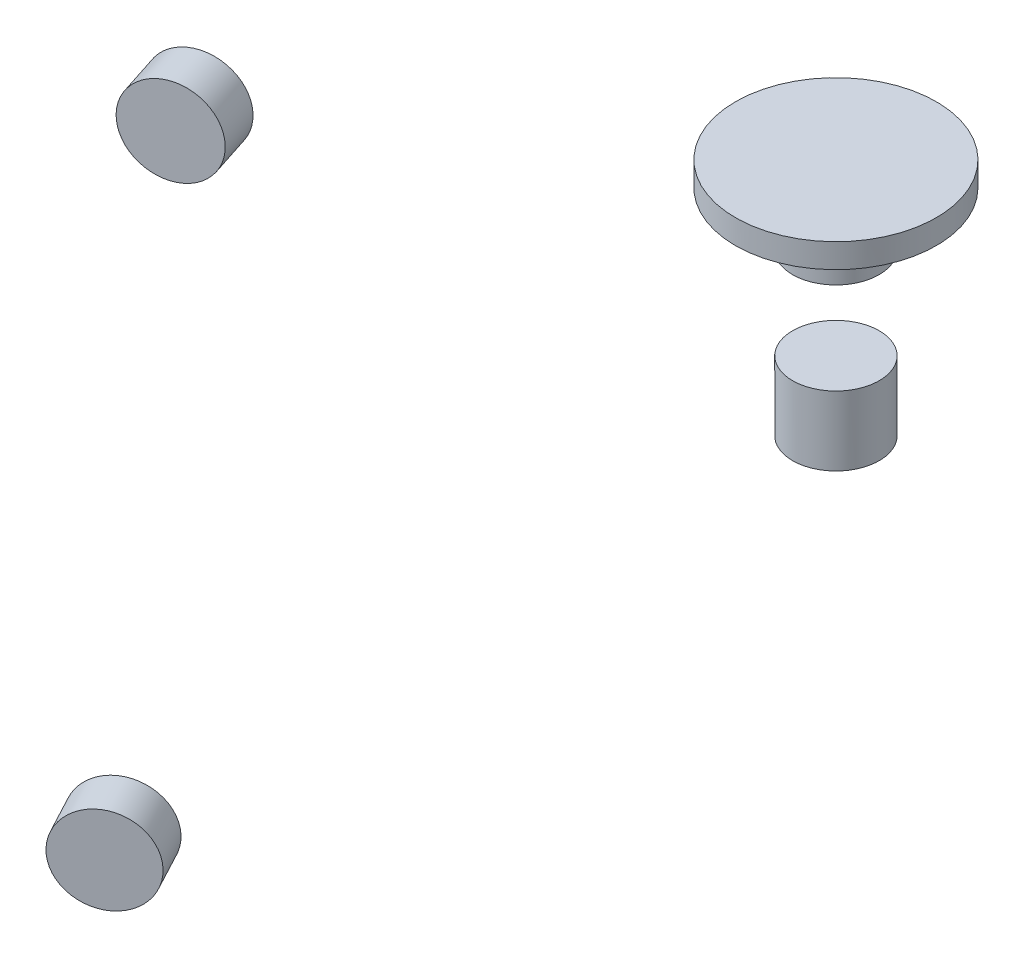
ISO-10303-21;
HEADER;
FILE_DESCRIPTION(('STEP AP214'),'2;1');
FILE_NAME('part.step','',(''),(''),'','','');
FILE_SCHEMA(('AUTOMOTIVE_DESIGN { 1 0 10303 214 1 1 1 1 }'));
ENDSEC;
DATA;
#1=APPLICATION_CONTEXT('core data for automotive mechanical design processes');
#2=APPLICATION_PROTOCOL_DEFINITION('international standard','automotive_design',2000,#1);
#3=PRODUCT_CONTEXT('',#1,'mechanical');
#4=PRODUCT('Part','Part','',(#3));
#5=PRODUCT_RELATED_PRODUCT_CATEGORY('part','',(#4));
#6=PRODUCT_DEFINITION_FORMATION('','',#4);
#7=PRODUCT_DEFINITION_CONTEXT('part definition',#1,'design');
#8=PRODUCT_DEFINITION('design','',#6,#7);
#9=PRODUCT_DEFINITION_SHAPE('','',#8);
#10=(LENGTH_UNIT() NAMED_UNIT(*) SI_UNIT(.MILLI.,.METRE.));
#11=(NAMED_UNIT(*) PLANE_ANGLE_UNIT() SI_UNIT($,.RADIAN.));
#12=(NAMED_UNIT(*) SI_UNIT($,.STERADIAN.) SOLID_ANGLE_UNIT());
#13=UNCERTAINTY_MEASURE_WITH_UNIT(LENGTH_MEASURE(1.E-05),#10,'distance_accuracy_value','');
#14=(GEOMETRIC_REPRESENTATION_CONTEXT(3) GLOBAL_UNCERTAINTY_ASSIGNED_CONTEXT((#13)) GLOBAL_UNIT_ASSIGNED_CONTEXT((#10,
#11,#12)) REPRESENTATION_CONTEXT('',''));
#15=CARTESIAN_POINT('',(0.,0.,0.));
#16=DIRECTION('',(0.,0.,1.));
#17=DIRECTION('',(1.,0.,0.));
#18=AXIS2_PLACEMENT_3D('',#15,#16,#17);
#19=CARTESIAN_POINT('',(-750.,-74.,0.));
#20=DIRECTION('',(0.,1.,0.));
#21=DIRECTION('',(0.,0.,1.));
#22=AXIS2_PLACEMENT_3D('',#19,#20,#21);
#23=PLANE('',#22);
#24=CARTESIAN_POINT('',(-750.,-74.,0.));
#25=DIRECTION('',(0.,1.,0.));
#26=DIRECTION('',(1.,0.,0.));
#27=AXIS2_PLACEMENT_3D('',#24,#25,#26);
#28=CIRCLE('',#27,25.);
#29=CARTESIAN_POINT('',(-725.,-74.,0.));
#30=VERTEX_POINT('',#29);
#31=EDGE_CURVE('E31',#30,#30,#28,.T.);
#32=ORIENTED_EDGE('',*,*,#31,.F.);
#33=EDGE_LOOP('',(#32));
#34=FACE_BOUND('',#33,.T.);
#35=ADVANCED_FACE('F70',(#34),#23,.F.);
#36=CARTESIAN_POINT('',(-750.,-74.,0.));
#37=DIRECTION('',(0.,1.,0.));
#38=DIRECTION('',(0.,0.,1.));
#39=AXIS2_PLACEMENT_3D('',#36,#37,#38);
#40=CYLINDRICAL_SURFACE('',#39,25.);
#41=ORIENTED_EDGE('',*,*,#31,.T.);
#42=EDGE_LOOP('',(#41));
#43=FACE_BOUND('',#42,.T.);
#44=CARTESIAN_POINT('',(-750.,-48.,0.));
#45=DIRECTION('',(0.,1.,0.));
#46=DIRECTION('',(0.,0.,1.));
#47=AXIS2_PLACEMENT_3D('',#44,#45,#46);
#48=CIRCLE('',#47,25.);
#49=CARTESIAN_POINT('',(-750.,-48.,25.));
#50=VERTEX_POINT('',#49);
#51=EDGE_CURVE('E54',#50,#50,#48,.F.);
#52=ORIENTED_EDGE('',*,*,#51,.T.);
#53=EDGE_LOOP('',(#52));
#54=FACE_BOUND('',#53,.T.);
#55=ADVANCED_FACE('F58',(#43,#54),#40,.T.);
#56=CARTESIAN_POINT('',(-750.,-48.,0.));
#57=DIRECTION('',(0.,1.,0.));
#58=DIRECTION('',(0.,0.,1.));
#59=AXIS2_PLACEMENT_3D('',#56,#57,#58);
#60=PLANE('',#59);
#61=ORIENTED_EDGE('',*,*,#51,.F.);
#62=EDGE_LOOP('',(#61));
#63=FACE_BOUND('',#62,.T.);
#64=ADVANCED_FACE('F60',(#63),#60,.T.);
#65=CLOSED_SHELL('',(#35,#55,#64));
#66=MANIFOLD_SOLID_BREP('B1',#65);
#67=CARTESIAN_POINT('',(-750.,-29.,0.));
#68=DIRECTION('',(0.,-1.,0.));
#69=DIRECTION('',(0.,0.,-1.));
#70=AXIS2_PLACEMENT_3D('',#67,#68,#69);
#71=PLANE('',#70);
#72=CARTESIAN_POINT('',(-750.,-29.,0.));
#73=DIRECTION('',(0.,-1.,0.));
#74=DIRECTION('',(-1.,0.,0.));
#75=AXIS2_PLACEMENT_3D('',#72,#73,#74);
#76=CIRCLE('',#75,58.);
#77=CARTESIAN_POINT('',(-808.,-29.,0.));
#78=VERTEX_POINT('',#77);
#79=EDGE_CURVE('E27',#78,#78,#76,.T.);
#80=ORIENTED_EDGE('',*,*,#79,.F.);
#81=EDGE_LOOP('',(#80));
#82=FACE_BOUND('',#81,.T.);
#83=ADVANCED_FACE('F85',(#82),#71,.F.);
#84=CARTESIAN_POINT('',(-750.,-29.,0.));
#85=DIRECTION('',(0.,-1.,0.));
#86=DIRECTION('',(0.,0.,-1.));
#87=AXIS2_PLACEMENT_3D('',#84,#85,#86);
#88=CYLINDRICAL_SURFACE('',#87,58.);
#89=ORIENTED_EDGE('',*,*,#79,.T.);
#90=EDGE_LOOP('',(#89));
#91=FACE_BOUND('',#90,.T.);
#92=CARTESIAN_POINT('',(-750.,-43.,0.));
#93=DIRECTION('',(0.,1.,0.));
#94=DIRECTION('',(0.,0.,1.));
#95=AXIS2_PLACEMENT_3D('',#92,#93,#94);
#96=CIRCLE('',#95,58.);
#97=CARTESIAN_POINT('',(-750.,-43.,58.));
#98=VERTEX_POINT('',#97);
#99=EDGE_CURVE('E50',#98,#98,#96,.F.);
#100=ORIENTED_EDGE('',*,*,#99,.F.);
#101=EDGE_LOOP('',(#100));
#102=FACE_BOUND('',#101,.T.);
#103=ADVANCED_FACE('F87',(#91,#102),#88,.T.);
#104=CARTESIAN_POINT('',(-750.,-43.,0.));
#105=DIRECTION('',(0.,1.,0.));
#106=DIRECTION('',(0.,0.,1.));
#107=AXIS2_PLACEMENT_3D('',#104,#105,#106);
#108=PLANE('',#107);
#109=ORIENTED_EDGE('',*,*,#99,.T.);
#110=EDGE_LOOP('',(#109));
#111=FACE_BOUND('',#110,.T.);
#112=ADVANCED_FACE('F93',(#111),#108,.F.);
#113=CLOSED_SHELL('',(#83,#103,#112));
#114=MANIFOLD_SOLID_BREP('B1',#113);
#115=CARTESIAN_POINT('',(-750.,-167.,0.));
#116=DIRECTION('',(0.,1.,0.));
#117=DIRECTION('',(0.,0.,1.));
#118=AXIS2_PLACEMENT_3D('',#115,#116,#117);
#119=PLANE('',#118);
#120=CARTESIAN_POINT('',(-750.,-167.,0.));
#121=DIRECTION('',(0.,1.,0.));
#122=DIRECTION('',(0.,0.,1.));
#123=AXIS2_PLACEMENT_3D('',#120,#121,#122);
#124=CIRCLE('',#123,25.);
#125=CARTESIAN_POINT('',(-750.,-167.,25.));
#126=VERTEX_POINT('',#125);
#127=EDGE_CURVE('E47',#126,#126,#124,.F.);
#128=ORIENTED_EDGE('',*,*,#127,.T.);
#129=EDGE_LOOP('',(#128));
#130=FACE_BOUND('',#129,.T.);
#131=ADVANCED_FACE('F112',(#130),#119,.F.);
#132=CARTESIAN_POINT('',(-750.,-127.,0.));
#133=DIRECTION('',(0.,-1.,0.));
#134=DIRECTION('',(0.,0.,-1.));
#135=AXIS2_PLACEMENT_3D('',#132,#133,#134);
#136=PLANE('',#135);
#137=CARTESIAN_POINT('',(-750.,-127.,0.));
#138=DIRECTION('',(0.,-1.,0.));
#139=DIRECTION('',(-1.,0.,0.));
#140=AXIS2_PLACEMENT_3D('',#137,#138,#139);
#141=CIRCLE('',#140,25.);
#142=CARTESIAN_POINT('',(-775.,-127.,0.));
#143=VERTEX_POINT('',#142);
#144=EDGE_CURVE('E36',#143,#143,#141,.T.);
#145=ORIENTED_EDGE('',*,*,#144,.F.);
#146=EDGE_LOOP('',(#145));
#147=FACE_BOUND('',#146,.T.);
#148=ADVANCED_FACE('F114',(#147),#136,.F.);
#149=CARTESIAN_POINT('',(-750.,-127.,0.));
#150=DIRECTION('',(0.,-1.,0.));
#151=DIRECTION('',(0.,0.,-1.));
#152=AXIS2_PLACEMENT_3D('',#149,#150,#151);
#153=CYLINDRICAL_SURFACE('',#152,25.);
#154=ORIENTED_EDGE('',*,*,#144,.T.);
#155=EDGE_LOOP('',(#154));
#156=FACE_BOUND('',#155,.T.);
#157=ORIENTED_EDGE('',*,*,#127,.F.);
#158=EDGE_LOOP('',(#157));
#159=FACE_BOUND('',#158,.T.);
#160=ADVANCED_FACE('F82',(#156,#159),#153,.T.);
#161=CLOSED_SHELL('',(#131,#148,#160));
#162=MANIFOLD_SOLID_BREP('B1',#161);
#163=CARTESIAN_POINT('',(-971.96285067294,-390.,200.264388190645));
#164=DIRECTION('',(0.46947156278589,0.,0.882947592858927));
#165=DIRECTION('',(-0.882947592858927,0.,0.46947156278589));
#166=AXIS2_PLACEMENT_3D('',#163,#164,#165);
#167=PLANE('',#166);
#168=CARTESIAN_POINT('',(-971.96285067294,-390.,200.264388190645));
#169=DIRECTION('',(0.46947156278589,0.,0.882947592858927));
#170=DIRECTION('',(0.,-1.,0.));
#171=AXIS2_PLACEMENT_3D('',#168,#169,#170);
#172=CIRCLE('',#171,25.);
#173=CARTESIAN_POINT('',(-971.96285067294,-415.,200.264388190645));
#174=VERTEX_POINT('',#173);
#175=EDGE_CURVE('E23',#174,#174,#172,.T.);
#176=ORIENTED_EDGE('',*,*,#175,.T.);
#177=EDGE_LOOP('',(#176));
#178=FACE_BOUND('',#177,.T.);
#179=ADVANCED_FACE('F95',(#178),#167,.T.);
#180=CARTESIAN_POINT('',(-971.96285067294,-390.,200.264388190645));
#181=DIRECTION('',(-0.46947156278589,0.,-0.882947592858927));
#182=DIRECTION('',(0.882947592858927,0.,-0.46947156278589));
#183=AXIS2_PLACEMENT_3D('',#180,#181,#182);
#184=CYLINDRICAL_SURFACE('',#183,25.);
#185=ORIENTED_EDGE('',*,*,#175,.F.);
#186=EDGE_LOOP('',(#185));
#187=FACE_BOUND('',#186,.T.);
#188=CARTESIAN_POINT('',(-983.699639742587,-390.,178.190698369173));
#189=DIRECTION('',(-0.46947156278589,0.,-0.882947592858927));
#190=DIRECTION('',(-0.882947592858927,0.,0.46947156278589));
#191=AXIS2_PLACEMENT_3D('',#188,#189,#190);
#192=CIRCLE('',#191,25.);
#193=CARTESIAN_POINT('',(-1005.77332956406,-390.,189.92748743882));
#194=VERTEX_POINT('',#193);
#195=EDGE_CURVE('E39',#194,#194,#192,.T.);
#196=ORIENTED_EDGE('',*,*,#195,.F.);
#197=EDGE_LOOP('',(#196));
#198=FACE_BOUND('',#197,.T.);
#199=ADVANCED_FACE('F98',(#187,#198),#184,.T.);
#200=CARTESIAN_POINT('',(-983.699639742587,-390.,178.190698369173));
#201=DIRECTION('',(-0.46947156278589,0.,-0.882947592858927));
#202=DIRECTION('',(-0.882947592858927,0.,0.46947156278589));
#203=AXIS2_PLACEMENT_3D('',#200,#201,#202);
#204=PLANE('',#203);
#205=ORIENTED_EDGE('',*,*,#195,.T.);
#206=EDGE_LOOP('',(#205));
#207=FACE_BOUND('',#206,.T.);
#208=ADVANCED_FACE('F102',(#207),#204,.T.);
#209=CLOSED_SHELL('',(#179,#199,#208));
#210=MANIFOLD_SOLID_BREP('B1',#209);
#211=CARTESIAN_POINT('',(-923.390816160371,4.00000000000069,210.653574430794));
#212=DIRECTION('',(0.309016994374948,0.,0.951056516295154));
#213=DIRECTION('',(-0.951056516295154,0.,0.309016994374947));
#214=AXIS2_PLACEMENT_3D('',#211,#212,#213);
#215=PLANE('',#214);
#216=CARTESIAN_POINT('',(-923.390816160371,4.00000000000069,210.653574430794));
#217=DIRECTION('',(0.309016994374948,0.,0.951056516295154));
#218=DIRECTION('',(0.,-1.,0.));
#219=AXIS2_PLACEMENT_3D('',#216,#217,#218);
#220=CIRCLE('',#219,25.);
#221=CARTESIAN_POINT('',(-923.390816160371,-20.9999999999993,210.653574430794));
#222=VERTEX_POINT('',#221);
#223=EDGE_CURVE('E10',#222,#222,#220,.T.);
#224=ORIENTED_EDGE('',*,*,#223,.T.);
#225=EDGE_LOOP('',(#224));
#226=FACE_BOUND('',#225,.T.);
#227=ADVANCED_FACE('F15',(#226),#215,.T.);
#228=CARTESIAN_POINT('',(-923.390816160371,4.00000000000069,210.653574430794));
#229=DIRECTION('',(-0.309016994374948,0.,-0.951056516295154));
#230=DIRECTION('',(0.951056516295154,0.,-0.309016994374947));
#231=AXIS2_PLACEMENT_3D('',#228,#229,#230);
#232=CYLINDRICAL_SURFACE('',#231,25.);
#233=ORIENTED_EDGE('',*,*,#223,.F.);
#234=EDGE_LOOP('',(#233));
#235=FACE_BOUND('',#234,.T.);
#236=CARTESIAN_POINT('',(-931.116241019745,4.00000000000069,186.877161523415));
#237=DIRECTION('',(-0.309016994374948,0.,-0.951056516295154));
#238=DIRECTION('',(-0.951056516295154,0.,0.309016994374948));
#239=AXIS2_PLACEMENT_3D('',#236,#237,#238);
#240=CIRCLE('',#239,25.);
#241=CARTESIAN_POINT('',(-954.892653927124,4.00000000000069,194.602586382789));
#242=VERTEX_POINT('',#241);
#243=EDGE_CURVE('E43',#242,#242,#240,.T.);
#244=ORIENTED_EDGE('',*,*,#243,.F.);
#245=EDGE_LOOP('',(#244));
#246=FACE_BOUND('',#245,.T.);
#247=ADVANCED_FACE('F17',(#235,#246),#232,.T.);
#248=CARTESIAN_POINT('',(-931.116241019745,4.00000000000069,186.877161523415));
#249=DIRECTION('',(-0.309016994374948,0.,-0.951056516295154));
#250=DIRECTION('',(-0.951056516295154,0.,0.309016994374948));
#251=AXIS2_PLACEMENT_3D('',#248,#249,#250);
#252=PLANE('',#251);
#253=ORIENTED_EDGE('',*,*,#243,.T.);
#254=EDGE_LOOP('',(#253));
#255=FACE_BOUND('',#254,.T.);
#256=ADVANCED_FACE('F109',(#255),#252,.T.);
#257=CLOSED_SHELL('',(#227,#247,#256));
#258=MANIFOLD_SOLID_BREP('B1',#257);
#259=ADVANCED_BREP_SHAPE_REPRESENTATION('',(#18,#66,#114,#162,#210,#258),#14);
#260=SHAPE_DEFINITION_REPRESENTATION(#9,#259);
ENDSEC;
END-ISO-10303-21;
